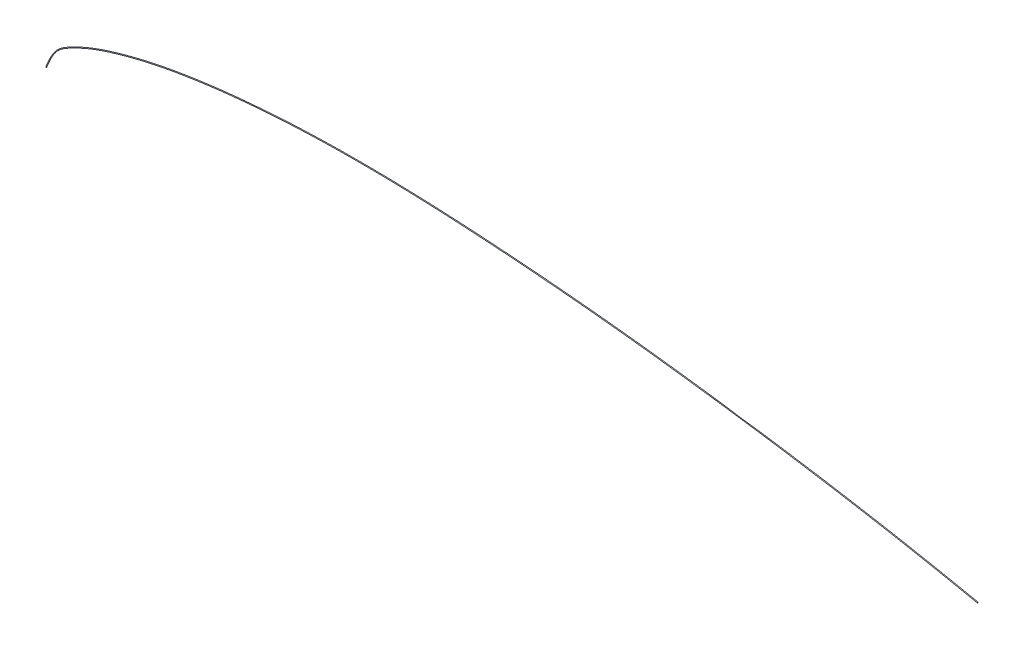
ISO-10303-21;
HEADER;
FILE_DESCRIPTION(('STEP AP214'),'2;1');
FILE_NAME('part.step','',(''),(''),'','','');
FILE_SCHEMA(('AUTOMOTIVE_DESIGN { 1 0 10303 214 1 1 1 1 }'));
ENDSEC;
DATA;
#1=APPLICATION_CONTEXT('core data for automotive mechanical design processes');
#2=APPLICATION_PROTOCOL_DEFINITION('international standard','automotive_design',2000,#1);
#3=PRODUCT_CONTEXT('',#1,'mechanical');
#4=PRODUCT('Part','Part','',(#3));
#5=PRODUCT_RELATED_PRODUCT_CATEGORY('part','',(#4));
#6=PRODUCT_DEFINITION_FORMATION('','',#4);
#7=PRODUCT_DEFINITION_CONTEXT('part definition',#1,'design');
#8=PRODUCT_DEFINITION('design','',#6,#7);
#9=PRODUCT_DEFINITION_SHAPE('','',#8);
#10=(LENGTH_UNIT() NAMED_UNIT(*) SI_UNIT(.MILLI.,.METRE.));
#11=(NAMED_UNIT(*) PLANE_ANGLE_UNIT() SI_UNIT($,.RADIAN.));
#12=(NAMED_UNIT(*) SI_UNIT($,.STERADIAN.) SOLID_ANGLE_UNIT());
#13=UNCERTAINTY_MEASURE_WITH_UNIT(LENGTH_MEASURE(1.E-05),#10,'distance_accuracy_value','');
#14=(GEOMETRIC_REPRESENTATION_CONTEXT(3) GLOBAL_UNCERTAINTY_ASSIGNED_CONTEXT((#13)) GLOBAL_UNIT_ASSIGNED_CONTEXT((#10,
#11,#12)) REPRESENTATION_CONTEXT('',''));
#15=CARTESIAN_POINT('',(0.,0.,0.));
#16=DIRECTION('',(0.,0.,1.));
#17=DIRECTION('',(1.,0.,0.));
#18=AXIS2_PLACEMENT_3D('',#15,#16,#17);
#19=CARTESIAN_POINT('',(1143.51,1.486563,0.));
#20=DIRECTION('',(0.981017726404871,0.193918076721637,0.));
#21=DIRECTION('',(0.,0.,1.));
#22=AXIS2_PLACEMENT_3D('',#19,#20,#21);
#23=PLANE('',#22);
#24=CARTESIAN_POINT('',(1143.51,1.486563,0.));
#25=DIRECTION('',(0.981017726404871,0.193918076721637,0.));
#26=DIRECTION('',(0.,0.,1.));
#27=AXIS2_PLACEMENT_3D('',#24,#25,#26);
#28=CIRCLE('',#27,0.5);
#29=CARTESIAN_POINT('',(1143.51,1.486563,0.5));
#30=VERTEX_POINT('',#29);
#31=EDGE_CURVE('E10',#30,#30,#28,.T.);
#32=ORIENTED_EDGE('',*,*,#31,.T.);
#33=EDGE_LOOP('',(#32));
#34=FACE_BOUND('',#33,.T.);
#35=ADVANCED_FACE('F39',(#34),#23,.T.);
#36=CARTESIAN_POINT('',(1143.51,1.486563,0.5));
#37=CARTESIAN_POINT('',(1124.46207060482,5.38974411269775,0.5));
#38=CARTESIAN_POINT('',(1105.4141412102,9.29292522407563,0.5));
#39=CARTESIAN_POINT('',(1029.38317967877,24.2088576357897,0.5));
#40=CARTESIAN_POINT('',(972.165379724474,34.0139840453461,0.5));
#41=CARTESIAN_POINT('',(876.754300763677,48.7648529899306,0.5));
#42=CARTESIAN_POINT('',(838.635614904716,54.2224738401747,0.5));
#43=CARTESIAN_POINT('',(762.400642536284,64.2291145867407,0.5));
#44=CARTESIAN_POINT('',(724.284739218981,68.7809880848684,0.5));
#45=CARTESIAN_POINT('',(648.043790834847,76.6614390836004,0.5));
#46=CARTESIAN_POINT('',(609.919128747438,79.9937079529373,0.5));
#47=CARTESIAN_POINT('',(533.678225680111,85.5801392898334,0.5));
#48=CARTESIAN_POINT('',(495.562165157022,87.8367519913323,0.5));
#49=CARTESIAN_POINT('',(419.304307356186,90.5487285366115,0.5));
#50=CARTESIAN_POINT('',(381.162639016645,91.0068472637165,0.5));
#51=CARTESIAN_POINT('',(304.863829096535,89.2084541382568,0.5));
#52=CARTESIAN_POINT('',(266.694921363674,86.9778200477368,0.5));
#53=CARTESIAN_POINT('',(209.48561215284,81.0164118034795,0.5));
#54=CARTESIAN_POINT('',(190.317278718343,78.5638013756268,0.5));
#55=CARTESIAN_POINT('',(152.136145317783,72.5133031307214,0.5));
#56=CARTESIAN_POINT('',(133.124023640907,68.9141766518025,0.5));
#57=CARTESIAN_POINT('',(104.679669718854,62.0435341883855,0.5));
#58=CARTESIAN_POINT('',(95.0717798047067,59.4592106570238,0.5));
#59=CARTESIAN_POINT('',(75.9498940817538,53.8284413194104,0.5));
#60=CARTESIAN_POINT('',(66.4377791275339,50.7795114415332,0.5));
#61=CARTESIAN_POINT('',(51.198012002929,44.9342966512661,0.5));
#62=CARTESIAN_POINT('',(45.3245774386292,42.4318795991824,0.5));
#63=CARTESIAN_POINT('',(36.6086483830433,38.3122228330052,0.5));
#64=CARTESIAN_POINT('',(33.7190424964081,36.8779987130043,0.5));
#65=CARTESIAN_POINT('',(27.9609287602858,33.8789725547974,0.5));
#66=CARTESIAN_POINT('',(25.0660187367064,32.3321325128898,0.5));
#67=CARTESIAN_POINT('',(19.5421071777571,28.9257430758887,0.5));
#68=CARTESIAN_POINT('',(16.9224303484844,27.0598498724912,0.5));
#69=CARTESIAN_POINT('',(12.3277842439242,22.7420671927505,0.5));
#70=CARTESIAN_POINT('',(10.3656214815009,20.2800240438444,0.5));
#71=CARTESIAN_POINT('',(5.15407876549317,12.2839240449656,0.5));
#72=CARTESIAN_POINT('',(2.57703938113762,6.14196202221847,0.5));
#73=CARTESIAN_POINT('',(0.,0.,0.5));
#74=CARTESIAN_POINT('',(1143.70391807672,0.50554527359513,0.5));
#75=CARTESIAN_POINT('',(1124.65598868155,4.40872638629077,0.5));
#76=CARTESIAN_POINT('',(1105.6108064302,8.31243855683846,0.5));
#77=CARTESIAN_POINT('',(1029.60168343433,23.2328785885634,0.5));
#78=CARTESIAN_POINT('',(972.395947717934,33.0408629657077,0.5));
#79=CARTESIAN_POINT('',(877.003005189012,47.7962448794968,0.5));
#80=CARTESIAN_POINT('',(838.891698231132,53.2557876942367,0.5));
#81=CARTESIAN_POINT('',(762.671741992761,63.2665318778937,0.5));
#82=CARTESIAN_POINT('',(724.564662838036,67.820907561146,0.5));
#83=CARTESIAN_POINT('',(648.343925696165,75.7074840380642,0.5));
#84=CARTESIAN_POINT('',(610.228737256552,79.0427977599006,0.5));
#85=CARTESIAN_POINT('',(534.005560572108,84.6351847450155,0.5));
#86=CARTESIAN_POINT('',(495.901344850365,86.8958990010136,0.5));
#87=CARTESIAN_POINT('',(419.672875701424,89.6189953315188,0.5));
#88=CARTESIAN_POINT('',(381.549505530026,90.0844063157171,0.5));
#89=CARTESIAN_POINT('',(305.294055543432,88.3054200530888,0.5));
#90=CARTESIAN_POINT('',(267.148220539226,86.085926596965,0.5));
#91=CARTESIAN_POINT('',(209.979703900395,80.1468616799469,0.5));
#92=CARTESIAN_POINT('',(190.826757783211,77.703086552974,0.5));
#93=CARTESIAN_POINT('',(152.679586568375,71.6736183505475,0.5));
#94=CARTESIAN_POINT('',(133.689775291689,68.0889277986573,0.5));
#95=CARTESIAN_POINT('',(105.286094382377,61.2482079139538,0.5));
#96=CARTESIAN_POINT('',(95.6910686792439,58.6738862975092,0.5));
#97=CARTESIAN_POINT('',(76.5938489272877,53.0632124538789,0.5));
#98=CARTESIAN_POINT('',(67.1020730483553,50.0310942553903,0.5));
#99=CARTESIAN_POINT('',(51.9070129440002,44.2286714893504,0.5));
#100=CARTESIAN_POINT('',(46.0512673837408,41.7444346065378,0.5));
#101=CARTESIAN_POINT('',(37.3610721261026,37.6534184352968,0.5));
#102=CARTESIAN_POINT('',(34.4799117555724,36.2289654333588,0.5));
#103=CARTESIAN_POINT('',(28.7382782054112,33.2497714201929,0.5));
#104=CARTESIAN_POINT('',(25.8538677874801,31.7147089317675,0.5));
#105=CARTESIAN_POINT('',(20.3809164664341,28.3795590570464,0.5));
#106=CARTESIAN_POINT('',(17.798474479872,26.5689525788122,0.5));
#107=CARTESIAN_POINT('',(13.2785838056553,22.4189361571236,0.5));
#108=CARTESIAN_POINT('',(11.3381782250594,20.0390876484918,0.5));
#109=CARTESIAN_POINT('',(6.16031267873579,12.2276997046709,0.5));
#110=CARTESIAN_POINT('',(3.57703938113762,6.1419620222157,0.5));
#111=CARTESIAN_POINT('',(1.,0.,0.5));
#112=CARTESIAN_POINT('',(1143.70391807672,0.50554527359513,-0.5));
#113=CARTESIAN_POINT('',(1124.65598868155,4.40872638629077,-0.5));
#114=CARTESIAN_POINT('',(1105.6108064302,8.31243855683846,-0.5));
#115=CARTESIAN_POINT('',(1029.60168343433,23.2328785885634,-0.5));
#116=CARTESIAN_POINT('',(972.395947717934,33.0408629657077,-0.5));
#117=CARTESIAN_POINT('',(877.003005189012,47.7962448794968,-0.5));
#118=CARTESIAN_POINT('',(838.891698231132,53.2557876942367,-0.5));
#119=CARTESIAN_POINT('',(762.671741992761,63.2665318778937,-0.5));
#120=CARTESIAN_POINT('',(724.564662838036,67.820907561146,-0.5));
#121=CARTESIAN_POINT('',(648.343925696165,75.7074840380642,-0.5));
#122=CARTESIAN_POINT('',(610.228737256552,79.0427977599006,-0.5));
#123=CARTESIAN_POINT('',(534.005560572108,84.6351847450155,-0.5));
#124=CARTESIAN_POINT('',(495.901344850365,86.8958990010136,-0.5));
#125=CARTESIAN_POINT('',(419.672875701424,89.6189953315188,-0.5));
#126=CARTESIAN_POINT('',(381.549505530026,90.0844063157171,-0.5));
#127=CARTESIAN_POINT('',(305.294055543432,88.3054200530888,-0.5));
#128=CARTESIAN_POINT('',(267.148220539226,86.085926596965,-0.5));
#129=CARTESIAN_POINT('',(209.979703900395,80.1468616799469,-0.5));
#130=CARTESIAN_POINT('',(190.826757783211,77.703086552974,-0.5));
#131=CARTESIAN_POINT('',(152.679586568375,71.6736183505475,-0.5));
#132=CARTESIAN_POINT('',(133.689775291689,68.0889277986573,-0.5));
#133=CARTESIAN_POINT('',(105.286094382377,61.2482079139538,-0.5));
#134=CARTESIAN_POINT('',(95.6910686792439,58.6738862975092,-0.5));
#135=CARTESIAN_POINT('',(76.5938489272877,53.0632124538789,-0.5));
#136=CARTESIAN_POINT('',(67.1020730483553,50.0310942553903,-0.5));
#137=CARTESIAN_POINT('',(51.9070129440002,44.2286714893504,-0.5));
#138=CARTESIAN_POINT('',(46.0512673837408,41.7444346065378,-0.5));
#139=CARTESIAN_POINT('',(37.3610721261026,37.6534184352968,-0.5));
#140=CARTESIAN_POINT('',(34.4799117555724,36.2289654333588,-0.5));
#141=CARTESIAN_POINT('',(28.7382782054112,33.2497714201929,-0.5));
#142=CARTESIAN_POINT('',(25.8538677874801,31.7147089317675,-0.5));
#143=CARTESIAN_POINT('',(20.3809164664341,28.3795590570464,-0.5));
#144=CARTESIAN_POINT('',(17.798474479872,26.5689525788122,-0.5));
#145=CARTESIAN_POINT('',(13.2785838056553,22.4189361571236,-0.5));
#146=CARTESIAN_POINT('',(11.3381782250594,20.0390876484918,-0.5));
#147=CARTESIAN_POINT('',(6.16031267873579,12.2276997046709,-0.5));
#148=CARTESIAN_POINT('',(3.57703938113762,6.1419620222157,-0.5));
#149=CARTESIAN_POINT('',(1.,0.,-0.5));
#150=CARTESIAN_POINT('',(1143.51,1.486563,-0.5));
#151=CARTESIAN_POINT('',(1124.46207060482,5.38974411269775,-0.5));
#152=CARTESIAN_POINT('',(1105.4141412102,9.29292522407563,-0.5));
#153=CARTESIAN_POINT('',(1029.38317967877,24.2088576357897,-0.5));
#154=CARTESIAN_POINT('',(972.165379724474,34.0139840453461,-0.5));
#155=CARTESIAN_POINT('',(876.754300763677,48.7648529899306,-0.5));
#156=CARTESIAN_POINT('',(838.635614904716,54.2224738401747,-0.5));
#157=CARTESIAN_POINT('',(762.400642536284,64.2291145867407,-0.5));
#158=CARTESIAN_POINT('',(724.284739218981,68.7809880848684,-0.5));
#159=CARTESIAN_POINT('',(648.043790834847,76.6614390836004,-0.5));
#160=CARTESIAN_POINT('',(609.919128747438,79.9937079529373,-0.5));
#161=CARTESIAN_POINT('',(533.678225680111,85.5801392898334,-0.5));
#162=CARTESIAN_POINT('',(495.562165157022,87.8367519913323,-0.5));
#163=CARTESIAN_POINT('',(419.304307356186,90.5487285366115,-0.5));
#164=CARTESIAN_POINT('',(381.162639016645,91.0068472637165,-0.5));
#165=CARTESIAN_POINT('',(304.863829096535,89.2084541382568,-0.5));
#166=CARTESIAN_POINT('',(266.694921363674,86.9778200477368,-0.5));
#167=CARTESIAN_POINT('',(209.48561215284,81.0164118034795,-0.5));
#168=CARTESIAN_POINT('',(190.317278718343,78.5638013756268,-0.5));
#169=CARTESIAN_POINT('',(152.136145317783,72.5133031307214,-0.5));
#170=CARTESIAN_POINT('',(133.124023640907,68.9141766518025,-0.5));
#171=CARTESIAN_POINT('',(104.679669718854,62.0435341883855,-0.5));
#172=CARTESIAN_POINT('',(95.0717798047067,59.4592106570238,-0.5));
#173=CARTESIAN_POINT('',(75.9498940817538,53.8284413194104,-0.5));
#174=CARTESIAN_POINT('',(66.4377791275339,50.7795114415332,-0.5));
#175=CARTESIAN_POINT('',(51.198012002929,44.9342966512661,-0.5));
#176=CARTESIAN_POINT('',(45.3245774386292,42.4318795991824,-0.5));
#177=CARTESIAN_POINT('',(36.6086483830433,38.3122228330052,-0.5));
#178=CARTESIAN_POINT('',(33.7190424964081,36.8779987130043,-0.5));
#179=CARTESIAN_POINT('',(27.9609287602858,33.8789725547974,-0.5));
#180=CARTESIAN_POINT('',(25.0660187367064,32.3321325128898,-0.5));
#181=CARTESIAN_POINT('',(19.5421071777571,28.9257430758887,-0.5));
#182=CARTESIAN_POINT('',(16.9224303484844,27.0598498724912,-0.5));
#183=CARTESIAN_POINT('',(12.3277842439242,22.7420671927505,-0.5));
#184=CARTESIAN_POINT('',(10.3656214815009,20.2800240438444,-0.5));
#185=CARTESIAN_POINT('',(5.15407876549317,12.2839240449656,-0.5));
#186=CARTESIAN_POINT('',(2.57703938113762,6.14196202221847,-0.5));
#187=CARTESIAN_POINT('',(0.,0.,-0.5));
#188=CARTESIAN_POINT('',(1143.31608192328,2.46758072640487,-0.5));
#189=CARTESIAN_POINT('',(1124.2681525281,6.37076183910473,-0.5));
#190=CARTESIAN_POINT('',(1105.21747599019,10.2734118913128,-0.5));
#191=CARTESIAN_POINT('',(1029.1646759232,25.1848366830161,-0.5));
#192=CARTESIAN_POINT('',(971.934811731013,34.9871051249845,-0.5));
#193=CARTESIAN_POINT('',(876.505596338342,49.7334611003644,-0.5));
#194=CARTESIAN_POINT('',(838.379531578301,55.1891599861127,-0.5));
#195=CARTESIAN_POINT('',(762.129543079807,65.1916972955877,-0.5));
#196=CARTESIAN_POINT('',(724.004815599926,69.7410686085908,-0.5));
#197=CARTESIAN_POINT('',(647.74365597353,77.6153941291365,-0.5));
#198=CARTESIAN_POINT('',(609.609520238324,80.944618145974,-0.5));
#199=CARTESIAN_POINT('',(533.350890788115,86.5250938346514,-0.5));
#200=CARTESIAN_POINT('',(495.222985463679,88.777604981651,-0.5));
#201=CARTESIAN_POINT('',(418.935739010949,91.4784617417042,-0.5));
#202=CARTESIAN_POINT('',(380.775772503264,91.929288211716,-0.5));
#203=CARTESIAN_POINT('',(304.433602649638,90.1114882234248,-0.5));
#204=CARTESIAN_POINT('',(266.241622188122,87.8697134985086,-0.5));
#205=CARTESIAN_POINT('',(208.991520405284,81.885961927012,-0.5));
#206=CARTESIAN_POINT('',(189.807799653475,79.4245161982797,-0.5));
#207=CARTESIAN_POINT('',(151.592704067192,73.3529879108952,-0.5));
#208=CARTESIAN_POINT('',(132.558271990125,69.7394255049477,-0.5));
#209=CARTESIAN_POINT('',(104.073245055332,62.8388604628172,-0.5));
#210=CARTESIAN_POINT('',(94.4524909301695,60.2445350165384,-0.5));
#211=CARTESIAN_POINT('',(75.3059392362198,54.5936701849418,-0.5));
#212=CARTESIAN_POINT('',(65.7734852067126,51.527928627676,-0.5));
#213=CARTESIAN_POINT('',(50.4890110618579,45.6399218131818,-0.5));
#214=CARTESIAN_POINT('',(44.5978874935177,43.1193245918269,-0.5));
#215=CARTESIAN_POINT('',(35.856224639984,38.9710272307136,-0.5));
#216=CARTESIAN_POINT('',(32.9581732372439,37.5270319926498,-0.5));
#217=CARTESIAN_POINT('',(27.1835793151603,34.508173689402,-0.5));
#218=CARTESIAN_POINT('',(24.2781696859326,32.9495560940121,-0.5));
#219=CARTESIAN_POINT('',(18.7032978890801,29.471927094731,-0.5));
#220=CARTESIAN_POINT('',(16.0463862170967,27.5507471661702,-0.5));
#221=CARTESIAN_POINT('',(11.3769846821931,23.0651982283773,-0.5));
#222=CARTESIAN_POINT('',(9.39306473794243,20.5209604391971,-0.5));
#223=CARTESIAN_POINT('',(4.14784485225054,12.3401483852604,-0.5));
#224=CARTESIAN_POINT('',(1.57703938113762,6.14196202222125,-0.5));
#225=CARTESIAN_POINT('',(-1.,0.,-0.5));
#226=CARTESIAN_POINT('',(1143.31608192328,2.46758072640487,0.5));
#227=CARTESIAN_POINT('',(1124.2681525281,6.37076183910473,0.5));
#228=CARTESIAN_POINT('',(1105.21747599019,10.2734118913128,0.5));
#229=CARTESIAN_POINT('',(1029.1646759232,25.1848366830161,0.5));
#230=CARTESIAN_POINT('',(971.934811731013,34.9871051249845,0.5));
#231=CARTESIAN_POINT('',(876.505596338342,49.7334611003644,0.5));
#232=CARTESIAN_POINT('',(838.379531578301,55.1891599861127,0.5));
#233=CARTESIAN_POINT('',(762.129543079807,65.1916972955877,0.5));
#234=CARTESIAN_POINT('',(724.004815599926,69.7410686085908,0.5));
#235=CARTESIAN_POINT('',(647.74365597353,77.6153941291365,0.5));
#236=CARTESIAN_POINT('',(609.609520238324,80.944618145974,0.5));
#237=CARTESIAN_POINT('',(533.350890788115,86.5250938346514,0.5));
#238=CARTESIAN_POINT('',(495.222985463679,88.777604981651,0.5));
#239=CARTESIAN_POINT('',(418.935739010949,91.4784617417042,0.5));
#240=CARTESIAN_POINT('',(380.775772503264,91.929288211716,0.5));
#241=CARTESIAN_POINT('',(304.433602649638,90.1114882234248,0.5));
#242=CARTESIAN_POINT('',(266.241622188122,87.8697134985086,0.5));
#243=CARTESIAN_POINT('',(208.991520405284,81.885961927012,0.5));
#244=CARTESIAN_POINT('',(189.807799653475,79.4245161982797,0.5));
#245=CARTESIAN_POINT('',(151.592704067192,73.3529879108952,0.5));
#246=CARTESIAN_POINT('',(132.558271990125,69.7394255049477,0.5));
#247=CARTESIAN_POINT('',(104.073245055332,62.8388604628172,0.5));
#248=CARTESIAN_POINT('',(94.4524909301695,60.2445350165384,0.5));
#249=CARTESIAN_POINT('',(75.3059392362198,54.5936701849418,0.5));
#250=CARTESIAN_POINT('',(65.7734852067126,51.527928627676,0.5));
#251=CARTESIAN_POINT('',(50.4890110618579,45.6399218131818,0.5));
#252=CARTESIAN_POINT('',(44.5978874935177,43.1193245918269,0.5));
#253=CARTESIAN_POINT('',(35.856224639984,38.9710272307136,0.5));
#254=CARTESIAN_POINT('',(32.9581732372439,37.5270319926498,0.5));
#255=CARTESIAN_POINT('',(27.1835793151603,34.508173689402,0.5));
#256=CARTESIAN_POINT('',(24.2781696859326,32.9495560940121,0.5));
#257=CARTESIAN_POINT('',(18.7032978890801,29.471927094731,0.5));
#258=CARTESIAN_POINT('',(16.0463862170967,27.5507471661702,0.5));
#259=CARTESIAN_POINT('',(11.3769846821931,23.0651982283773,0.5));
#260=CARTESIAN_POINT('',(9.39306473794243,20.5209604391971,0.5));
#261=CARTESIAN_POINT('',(4.14784485225054,12.3401483852604,0.5));
#262=CARTESIAN_POINT('',(1.57703938113762,6.14196202222125,0.5));
#263=CARTESIAN_POINT('',(-1.,0.,0.5));
#264=CARTESIAN_POINT('',(1143.51,1.486563,0.5));
#265=CARTESIAN_POINT('',(1124.46207060482,5.38974411269775,0.5));
#266=CARTESIAN_POINT('',(1105.4141412102,9.29292522407563,0.5));
#267=CARTESIAN_POINT('',(1029.38317967877,24.2088576357897,0.5));
#268=CARTESIAN_POINT('',(972.165379724474,34.0139840453461,0.5));
#269=CARTESIAN_POINT('',(876.754300763677,48.7648529899306,0.5));
#270=CARTESIAN_POINT('',(838.635614904716,54.2224738401747,0.5));
#271=CARTESIAN_POINT('',(762.400642536284,64.2291145867407,0.5));
#272=CARTESIAN_POINT('',(724.284739218981,68.7809880848684,0.5));
#273=CARTESIAN_POINT('',(648.043790834847,76.6614390836004,0.5));
#274=CARTESIAN_POINT('',(609.919128747438,79.9937079529373,0.5));
#275=CARTESIAN_POINT('',(533.678225680111,85.5801392898334,0.5));
#276=CARTESIAN_POINT('',(495.562165157022,87.8367519913323,0.5));
#277=CARTESIAN_POINT('',(419.304307356186,90.5487285366115,0.5));
#278=CARTESIAN_POINT('',(381.162639016645,91.0068472637165,0.5));
#279=CARTESIAN_POINT('',(304.863829096535,89.2084541382568,0.5));
#280=CARTESIAN_POINT('',(266.694921363674,86.9778200477368,0.5));
#281=CARTESIAN_POINT('',(209.48561215284,81.0164118034795,0.5));
#282=CARTESIAN_POINT('',(190.317278718343,78.5638013756268,0.5));
#283=CARTESIAN_POINT('',(152.136145317783,72.5133031307214,0.5));
#284=CARTESIAN_POINT('',(133.124023640907,68.9141766518025,0.5));
#285=CARTESIAN_POINT('',(104.679669718854,62.0435341883855,0.5));
#286=CARTESIAN_POINT('',(95.0717798047067,59.4592106570238,0.5));
#287=CARTESIAN_POINT('',(75.9498940817538,53.8284413194104,0.5));
#288=CARTESIAN_POINT('',(66.4377791275339,50.7795114415332,0.5));
#289=CARTESIAN_POINT('',(51.198012002929,44.9342966512661,0.5));
#290=CARTESIAN_POINT('',(45.3245774386292,42.4318795991824,0.5));
#291=CARTESIAN_POINT('',(36.6086483830433,38.3122228330052,0.5));
#292=CARTESIAN_POINT('',(33.7190424964081,36.8779987130043,0.5));
#293=CARTESIAN_POINT('',(27.9609287602858,33.8789725547974,0.5));
#294=CARTESIAN_POINT('',(25.0660187367064,32.3321325128898,0.5));
#295=CARTESIAN_POINT('',(19.5421071777571,28.9257430758887,0.5));
#296=CARTESIAN_POINT('',(16.9224303484844,27.0598498724912,0.5));
#297=CARTESIAN_POINT('',(12.3277842439242,22.7420671927505,0.5));
#298=CARTESIAN_POINT('',(10.3656214815009,20.2800240438444,0.5));
#299=CARTESIAN_POINT('',(5.15407876549317,12.2839240449656,0.5));
#300=CARTESIAN_POINT('',(2.57703938113762,6.14196202221847,0.5));
#301=CARTESIAN_POINT('',(0.,0.,0.5));
#302=(BOUNDED_SURFACE() B_SPLINE_SURFACE(3,3,((#36,#37,#38,#39,#40,#41,#42,#43,#44,#45,#46,#47,
#48,#49,#50,#51,#52,#53,#54,#55,#56,#57,#58,#59,#60,#61,#62,#63,#64,#65,#66,#67,#68,#69,#70,#71,
#72,#73),(#74,#75,#76,#77,#78,#79,#80,#81,#82,#83,#84,#85,#86,#87,#88,#89,#90,#91,#92,#93,#94,
#95,#96,#97,#98,#99,#100,#101,#102,#103,#104,#105,#106,#107,#108,#109,#110,#111),(#112,#113,
#114,#115,#116,#117,#118,#119,#120,#121,#122,#123,#124,#125,#126,#127,#128,#129,#130,#131,#132,
#133,#134,#135,#136,#137,#138,#139,#140,#141,#142,#143,#144,#145,#146,#147,#148,#149),(#150,
#151,#152,#153,#154,#155,#156,#157,#158,#159,#160,#161,#162,#163,#164,#165,#166,#167,#168,#169,
#170,#171,#172,#173,#174,#175,#176,#177,#178,#179,#180,#181,#182,#183,#184,#185,#186,#187),
(#188,#189,#190,#191,#192,#193,#194,#195,#196,#197,#198,#199,#200,#201,#202,#203,#204,#205,#206,
#207,#208,#209,#210,#211,#212,#213,#214,#215,#216,#217,#218,#219,#220,#221,#222,#223,#224,#225),
(#226,#227,#228,#229,#230,#231,#232,#233,#234,#235,#236,#237,#238,#239,#240,#241,#242,#243,#244,
#245,#246,#247,#248,#249,#250,#251,#252,#253,#254,#255,#256,#257,#258,#259,#260,#261,#262,#263),
(#264,#265,#266,#267,#268,#269,#270,#271,#272,#273,#274,#275,#276,#277,#278,#279,#280,#281,#282,
#283,#284,#285,#286,#287,#288,#289,#290,#291,#292,#293,#294,#295,#296,#297,#298,#299,#300,
#301)),.UNSPECIFIED.,.T.,.F.,.F.) B_SPLINE_SURFACE_WITH_KNOTS((4,3,4),(4,2,2,2,2,2,2,2,2,2,2,2,
2,2,2,2,2,2,4),(0.,0.5,1.),(0.,0.0496812988513004,0.197976307844625,0.296362491062684,
0.394433617199178,0.492205408317245,0.589753408165241,0.687151928165711,0.784753711389578,
0.834119584128113,0.883485456866648,0.908917356863356,0.934349256860064,0.950761942645048,
0.95896828553754,0.967174628430032,0.975380971322524,0.983587314215016,1.),
.UNSPECIFIED.) GEOMETRIC_REPRESENTATION_ITEM() RATIONAL_B_SPLINE_SURFACE(((1.,1.,1.,1.,1.,1.,1.,
1.,1.,1.,1.,1.,1.,1.,1.,1.,1.,1.,1.,1.,1.,1.,1.,1.,1.,1.,1.,1.,1.,1.,1.,1.,1.,1.,1.,1.,1.,1.),
(0.333333333333333,0.333333333333333,0.333333333333333,0.333333333333333,0.333333333333333,
0.333333333333333,0.333333333333333,0.333333333333333,0.333333333333333,0.333333333333333,
0.333333333333333,0.333333333333333,0.333333333333333,0.333333333333333,0.333333333333333,
0.333333333333333,0.333333333333333,0.333333333333333,0.333333333333333,0.333333333333333,
0.333333333333333,0.333333333333333,0.333333333333333,0.333333333333333,0.333333333333333,
0.333333333333333,0.333333333333333,0.333333333333333,0.333333333333333,0.333333333333333,
0.333333333333333,0.333333333333333,0.333333333333333,0.333333333333333,0.333333333333333,
0.333333333333333,0.333333333333333,0.333333333333333),(0.333333333333333,0.333333333333333,
0.333333333333333,0.333333333333333,0.333333333333333,0.333333333333333,0.333333333333333,
0.333333333333333,0.333333333333333,0.333333333333333,0.333333333333333,0.333333333333333,
0.333333333333333,0.333333333333333,0.333333333333333,0.333333333333333,0.333333333333333,
0.333333333333333,0.333333333333333,0.333333333333333,0.333333333333333,0.333333333333333,
0.333333333333333,0.333333333333333,0.333333333333333,0.333333333333333,0.333333333333333,
0.333333333333333,0.333333333333333,0.333333333333333,0.333333333333333,0.333333333333333,
0.333333333333333,0.333333333333333,0.333333333333333,0.333333333333333,0.333333333333333,
0.333333333333333),(1.,1.,1.,1.,1.,1.,1.,1.,1.,1.,1.,1.,1.,1.,1.,1.,1.,1.,1.,1.,1.,1.,1.,1.,1.,
1.,1.,1.,1.,1.,1.,1.,1.,1.,1.,1.,1.,1.),(0.333333333333333,0.333333333333333,0.333333333333333,
0.333333333333333,0.333333333333333,0.333333333333333,0.333333333333333,0.333333333333333,
0.333333333333333,0.333333333333333,0.333333333333333,0.333333333333333,0.333333333333333,
0.333333333333333,0.333333333333333,0.333333333333333,0.333333333333333,0.333333333333333,
0.333333333333333,0.333333333333333,0.333333333333333,0.333333333333333,0.333333333333333,
0.333333333333333,0.333333333333333,0.333333333333333,0.333333333333333,0.333333333333333,
0.333333333333333,0.333333333333333,0.333333333333333,0.333333333333333,0.333333333333333,
0.333333333333333,0.333333333333333,0.333333333333333,0.333333333333333,0.333333333333333),
(0.333333333333333,0.333333333333333,0.333333333333333,0.333333333333333,0.333333333333333,
0.333333333333333,0.333333333333333,0.333333333333333,0.333333333333333,0.333333333333333,
0.333333333333333,0.333333333333333,0.333333333333333,0.333333333333333,0.333333333333333,
0.333333333333333,0.333333333333333,0.333333333333333,0.333333333333333,0.333333333333333,
0.333333333333333,0.333333333333333,0.333333333333333,0.333333333333333,0.333333333333333,
0.333333333333333,0.333333333333333,0.333333333333333,0.333333333333333,0.333333333333333,
0.333333333333333,0.333333333333333,0.333333333333333,0.333333333333333,0.333333333333333,
0.333333333333333,0.333333333333333,0.333333333333333),(1.,1.,1.,1.,1.,1.,1.,1.,1.,1.,1.,1.,1.,
1.,1.,1.,1.,1.,1.,1.,1.,1.,1.,1.,1.,1.,1.,1.,1.,1.,1.,1.,1.,1.,1.,1.,1.,1.))) REPRESENTATION_ITEM('') SURFACE());
#303=CARTESIAN_POINT('',(0.,0.,0.));
#304=DIRECTION('',(0.,1.,0.));
#305=DIRECTION('',(0.,0.,1.));
#306=AXIS2_PLACEMENT_3D('',#303,#304,#305);
#307=CIRCLE('',#306,0.5);
#308=CARTESIAN_POINT('',(0.,0.,0.5));
#309=VERTEX_POINT('',#308);
#310=EDGE_CURVE('E49',#309,#309,#307,.T.);
#311=ORIENTED_EDGE('',*,*,#310,.T.);
#312=EDGE_LOOP('',(#311));
#313=FACE_BOUND('',#312,.T.);
#314=ORIENTED_EDGE('',*,*,#31,.F.);
#315=EDGE_LOOP('',(#314));
#316=FACE_BOUND('',#315,.T.);
#317=ADVANCED_FACE('F56',(#313,#316),#302,.F.);
#318=CARTESIAN_POINT('',(0.,-1.,0.));
#319=DIRECTION('',(0.,1.,0.));
#320=DIRECTION('',(0.,0.,1.));
#321=AXIS2_PLACEMENT_3D('',#318,#319,#320);
#322=CYLINDRICAL_SURFACE('',#321,0.5);
#323=CARTESIAN_POINT('',(0.,-1.,0.));
#324=DIRECTION('',(0.,1.,0.));
#325=DIRECTION('',(0.,0.,1.));
#326=AXIS2_PLACEMENT_3D('',#323,#324,#325);
#327=CIRCLE('',#326,0.5);
#328=CARTESIAN_POINT('',(0.,-1.,0.5));
#329=VERTEX_POINT('',#328);
#330=EDGE_CURVE('E45',#329,#329,#327,.T.);
#331=ORIENTED_EDGE('',*,*,#330,.T.);
#332=EDGE_LOOP('',(#331));
#333=FACE_BOUND('',#332,.T.);
#334=ORIENTED_EDGE('',*,*,#310,.F.);
#335=EDGE_LOOP('',(#334));
#336=FACE_BOUND('',#335,.T.);
#337=ADVANCED_FACE('F59',(#333,#336),#322,.T.);
#338=CARTESIAN_POINT('',(0.,-1.,0.));
#339=DIRECTION('',(0.,1.,0.));
#340=DIRECTION('',(0.,0.,1.));
#341=AXIS2_PLACEMENT_3D('',#338,#339,#340);
#342=PLANE('',#341);
#343=ORIENTED_EDGE('',*,*,#330,.F.);
#344=EDGE_LOOP('',(#343));
#345=FACE_BOUND('',#344,.T.);
#346=ADVANCED_FACE('F61',(#345),#342,.F.);
#347=CLOSED_SHELL('',(#35,#317,#337,#346));
#348=MANIFOLD_SOLID_BREP('B2',#347);
#349=ADVANCED_BREP_SHAPE_REPRESENTATION('',(#18,#348),#14);
#350=SHAPE_DEFINITION_REPRESENTATION(#9,#349);
ENDSEC;
END-ISO-10303-21;
